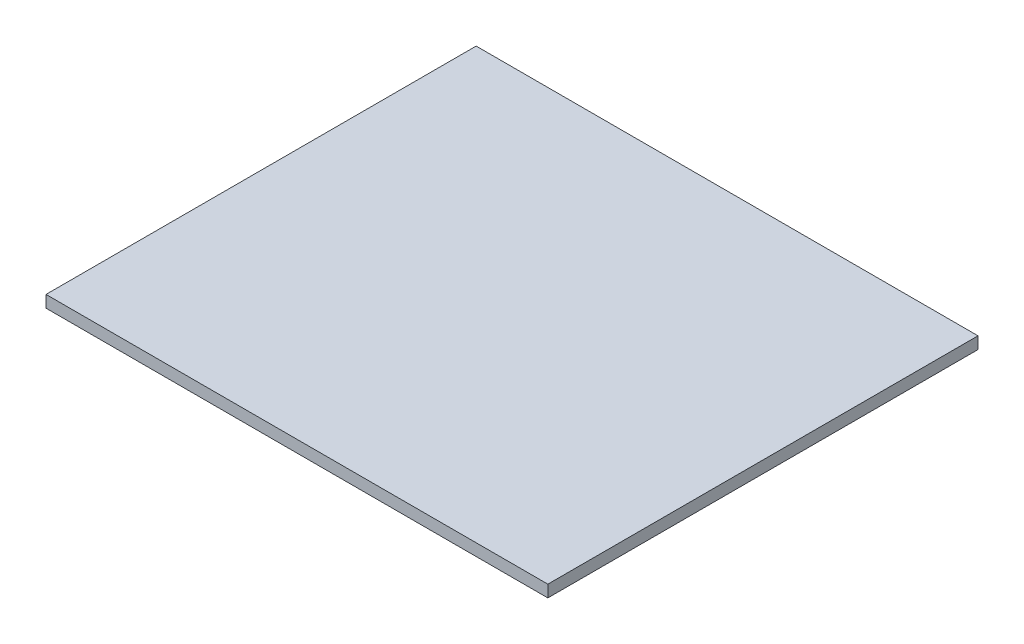
ISO-10303-21;
HEADER;
FILE_DESCRIPTION(('STEP AP214'),'2;1');
FILE_NAME('part.step','',(''),(''),'','','');
FILE_SCHEMA(('AUTOMOTIVE_DESIGN { 1 0 10303 214 1 1 1 1 }'));
ENDSEC;
DATA;
#1=APPLICATION_CONTEXT('core data for automotive mechanical design processes');
#2=APPLICATION_PROTOCOL_DEFINITION('international standard','automotive_design',2000,#1);
#3=PRODUCT_CONTEXT('',#1,'mechanical');
#4=PRODUCT('Part','Part','',(#3));
#5=PRODUCT_RELATED_PRODUCT_CATEGORY('part','',(#4));
#6=PRODUCT_DEFINITION_FORMATION('','',#4);
#7=PRODUCT_DEFINITION_CONTEXT('part definition',#1,'design');
#8=PRODUCT_DEFINITION('design','',#6,#7);
#9=PRODUCT_DEFINITION_SHAPE('','',#8);
#10=(LENGTH_UNIT() NAMED_UNIT(*) SI_UNIT(.MILLI.,.METRE.));
#11=(NAMED_UNIT(*) PLANE_ANGLE_UNIT() SI_UNIT($,.RADIAN.));
#12=(NAMED_UNIT(*) SI_UNIT($,.STERADIAN.) SOLID_ANGLE_UNIT());
#13=UNCERTAINTY_MEASURE_WITH_UNIT(LENGTH_MEASURE(1.E-05),#10,'distance_accuracy_value','');
#14=(GEOMETRIC_REPRESENTATION_CONTEXT(3) GLOBAL_UNCERTAINTY_ASSIGNED_CONTEXT((#13)) GLOBAL_UNIT_ASSIGNED_CONTEXT((#10,
#11,#12)) REPRESENTATION_CONTEXT('',''));
#15=CARTESIAN_POINT('',(0.,0.,0.));
#16=DIRECTION('',(0.,0.,1.));
#17=DIRECTION('',(1.,0.,0.));
#18=AXIS2_PLACEMENT_3D('',#15,#16,#17);
#19=CARTESIAN_POINT('',(-133.35,3.175,-114.3));
#20=DIRECTION('',(1.,0.,0.));
#21=DIRECTION('',(0.,0.,-1.));
#22=AXIS2_PLACEMENT_3D('',#19,#20,#21);
#23=PLANE('',#22);
#24=DIRECTION('',(0.,0.,1.));
#25=VECTOR('',#24,1.);
#26=CARTESIAN_POINT('',(-133.35,-3.175,-114.3));
#27=LINE('',#26,#25);
#28=CARTESIAN_POINT('',(-133.35,-3.175,-114.3));
#29=VERTEX_POINT('',#28);
#30=CARTESIAN_POINT('',(-133.35,-3.175,114.3));
#31=VERTEX_POINT('',#30);
#32=EDGE_CURVE('E107',#29,#31,#27,.T.);
#33=ORIENTED_EDGE('',*,*,#32,.T.);
#34=DIRECTION('',(0.,-1.,0.));
#35=VECTOR('',#34,1.);
#36=CARTESIAN_POINT('',(-133.35,3.175,114.3));
#37=LINE('',#36,#35);
#38=CARTESIAN_POINT('',(-133.35,3.175,114.3));
#39=VERTEX_POINT('',#38);
#40=EDGE_CURVE('E11',#39,#31,#37,.T.);
#41=ORIENTED_EDGE('',*,*,#40,.F.);
#42=DIRECTION('',(0.,0.,1.));
#43=VECTOR('',#42,1.);
#44=CARTESIAN_POINT('',(-133.35,3.175,-114.3));
#45=LINE('',#44,#43);
#46=CARTESIAN_POINT('',(-133.35,3.175,-114.3));
#47=VERTEX_POINT('',#46);
#48=EDGE_CURVE('E89',#47,#39,#45,.T.);
#49=ORIENTED_EDGE('',*,*,#48,.F.);
#50=DIRECTION('',(0.,-1.,0.));
#51=VECTOR('',#50,1.);
#52=CARTESIAN_POINT('',(-133.35,3.175,-114.3));
#53=LINE('',#52,#51);
#54=EDGE_CURVE('E56',#47,#29,#53,.T.);
#55=ORIENTED_EDGE('',*,*,#54,.T.);
#56=EDGE_LOOP('',(#33,#41,#49,#55));
#57=FACE_BOUND('',#56,.T.);
#58=ADVANCED_FACE('F39',(#57),#23,.F.);
#59=CARTESIAN_POINT('',(-133.35,3.175,114.3));
#60=DIRECTION('',(0.,0.,-1.));
#61=DIRECTION('',(-1.,0.,0.));
#62=AXIS2_PLACEMENT_3D('',#59,#60,#61);
#63=PLANE('',#62);
#64=DIRECTION('',(1.,0.,0.));
#65=VECTOR('',#64,1.);
#66=CARTESIAN_POINT('',(-133.35,-3.175,114.3));
#67=LINE('',#66,#65);
#68=CARTESIAN_POINT('',(133.35,-3.175,114.3));
#69=VERTEX_POINT('',#68);
#70=EDGE_CURVE('E95',#31,#69,#67,.T.);
#71=ORIENTED_EDGE('',*,*,#70,.T.);
#72=DIRECTION('',(0.,-1.,0.));
#73=VECTOR('',#72,1.);
#74=CARTESIAN_POINT('',(133.35,3.175,114.3));
#75=LINE('',#74,#73);
#76=CARTESIAN_POINT('',(133.35,3.175,114.3));
#77=VERTEX_POINT('',#76);
#78=EDGE_CURVE('E48',#77,#69,#75,.T.);
#79=ORIENTED_EDGE('',*,*,#78,.F.);
#80=DIRECTION('',(1.,0.,0.));
#81=VECTOR('',#80,1.);
#82=CARTESIAN_POINT('',(-133.35,3.175,114.3));
#83=LINE('',#82,#81);
#84=EDGE_CURVE('E81',#39,#77,#83,.T.);
#85=ORIENTED_EDGE('',*,*,#84,.F.);
#86=ORIENTED_EDGE('',*,*,#40,.T.);
#87=EDGE_LOOP('',(#71,#79,#85,#86));
#88=FACE_BOUND('',#87,.T.);
#89=ADVANCED_FACE('F94',(#88),#63,.F.);
#90=CARTESIAN_POINT('',(133.35,3.175,-114.3));
#91=DIRECTION('',(1.,0.,0.));
#92=DIRECTION('',(0.,0.,-1.));
#93=AXIS2_PLACEMENT_3D('',#90,#91,#92);
#94=PLANE('',#93);
#95=DIRECTION('',(0.,0.,1.));
#96=VECTOR('',#95,1.);
#97=CARTESIAN_POINT('',(133.35,-3.175,-114.3));
#98=LINE('',#97,#96);
#99=CARTESIAN_POINT('',(133.35,-3.175,-114.3));
#100=VERTEX_POINT('',#99);
#101=EDGE_CURVE('E112',#100,#69,#98,.T.);
#102=ORIENTED_EDGE('',*,*,#101,.F.);
#103=DIRECTION('',(0.,-1.,0.));
#104=VECTOR('',#103,1.);
#105=CARTESIAN_POINT('',(133.35,3.175,-114.3));
#106=LINE('',#105,#104);
#107=CARTESIAN_POINT('',(133.35,3.175,-114.3));
#108=VERTEX_POINT('',#107);
#109=EDGE_CURVE('E70',#108,#100,#106,.T.);
#110=ORIENTED_EDGE('',*,*,#109,.F.);
#111=DIRECTION('',(0.,0.,1.));
#112=VECTOR('',#111,1.);
#113=CARTESIAN_POINT('',(133.35,3.175,-114.3));
#114=LINE('',#113,#112);
#115=EDGE_CURVE('E88',#108,#77,#114,.T.);
#116=ORIENTED_EDGE('',*,*,#115,.T.);
#117=ORIENTED_EDGE('',*,*,#78,.T.);
#118=EDGE_LOOP('',(#102,#110,#116,#117));
#119=FACE_BOUND('',#118,.T.);
#120=ADVANCED_FACE('F99',(#119),#94,.T.);
#121=CARTESIAN_POINT('',(-133.35,3.175,-114.3));
#122=DIRECTION('',(0.,0.,-1.));
#123=DIRECTION('',(-1.,0.,0.));
#124=AXIS2_PLACEMENT_3D('',#121,#122,#123);
#125=PLANE('',#124);
#126=DIRECTION('',(1.,0.,0.));
#127=VECTOR('',#126,1.);
#128=CARTESIAN_POINT('',(-133.35,-3.175,-114.3));
#129=LINE('',#128,#127);
#130=EDGE_CURVE('E115',#29,#100,#129,.T.);
#131=ORIENTED_EDGE('',*,*,#130,.F.);
#132=ORIENTED_EDGE('',*,*,#54,.F.);
#133=DIRECTION('',(1.,0.,0.));
#134=VECTOR('',#133,1.);
#135=CARTESIAN_POINT('',(-133.35,3.175,-114.3));
#136=LINE('',#135,#134);
#137=EDGE_CURVE('E101',#47,#108,#136,.T.);
#138=ORIENTED_EDGE('',*,*,#137,.T.);
#139=ORIENTED_EDGE('',*,*,#109,.T.);
#140=EDGE_LOOP('',(#131,#132,#138,#139));
#141=FACE_BOUND('',#140,.T.);
#142=ADVANCED_FACE('F125',(#141),#125,.T.);
#143=CARTESIAN_POINT('',(0.,3.175,0.));
#144=DIRECTION('',(0.,1.,0.));
#145=DIRECTION('',(0.,0.,1.));
#146=AXIS2_PLACEMENT_3D('',#143,#144,#145);
#147=PLANE('',#146);
#148=ORIENTED_EDGE('',*,*,#48,.T.);
#149=ORIENTED_EDGE('',*,*,#84,.T.);
#150=ORIENTED_EDGE('',*,*,#115,.F.);
#151=ORIENTED_EDGE('',*,*,#137,.F.);
#152=EDGE_LOOP('',(#148,#149,#150,#151));
#153=FACE_BOUND('',#152,.T.);
#154=ADVANCED_FACE('F85',(#153),#147,.T.);
#155=CARTESIAN_POINT('',(0.,-3.175,0.));
#156=DIRECTION('',(0.,1.,0.));
#157=DIRECTION('',(0.,0.,1.));
#158=AXIS2_PLACEMENT_3D('',#155,#156,#157);
#159=PLANE('',#158);
#160=ORIENTED_EDGE('',*,*,#32,.F.);
#161=ORIENTED_EDGE('',*,*,#130,.T.);
#162=ORIENTED_EDGE('',*,*,#101,.T.);
#163=ORIENTED_EDGE('',*,*,#70,.F.);
#164=EDGE_LOOP('',(#160,#161,#162,#163));
#165=FACE_BOUND('',#164,.T.);
#166=ADVANCED_FACE('F124',(#165),#159,.F.);
#167=CLOSED_SHELL('',(#58,#89,#120,#142,#154,#166));
#168=MANIFOLD_SOLID_BREP('B2',#167);
#169=ADVANCED_BREP_SHAPE_REPRESENTATION('',(#18,#168),#14);
#170=SHAPE_DEFINITION_REPRESENTATION(#9,#169);
ENDSEC;
END-ISO-10303-21;
